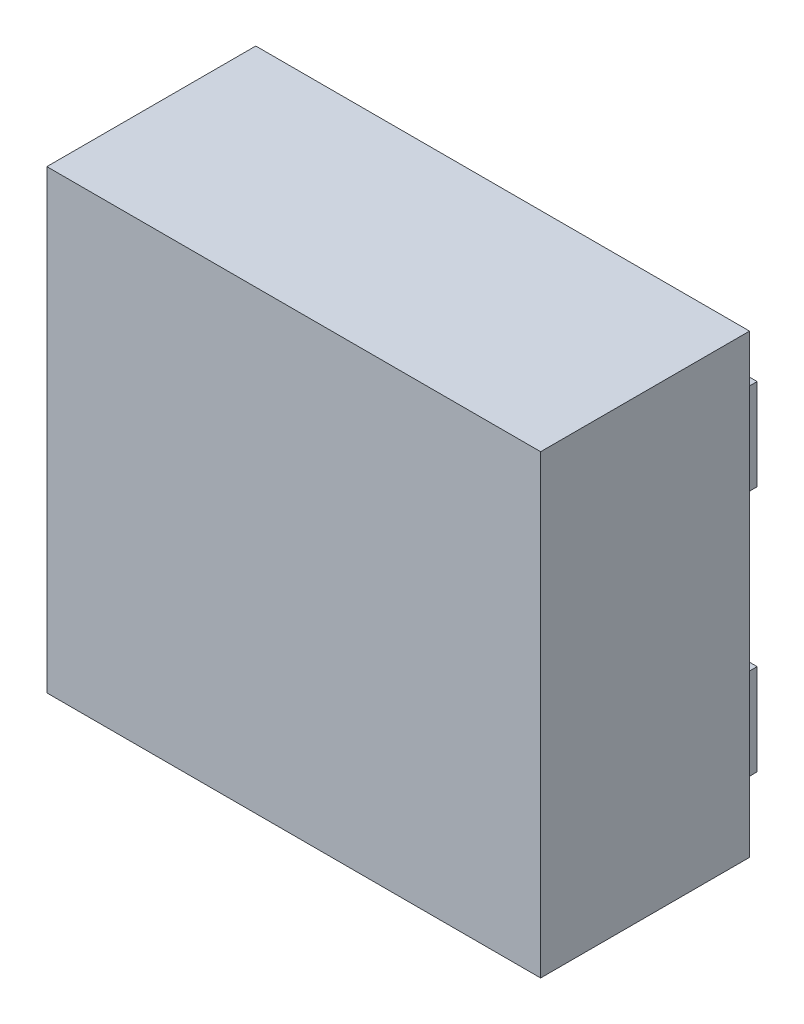
ISO-10303-21;
HEADER;
FILE_DESCRIPTION(('STEP AP214'),'2;1');
FILE_NAME('part.step','',(''),(''),'','','');
FILE_SCHEMA(('AUTOMOTIVE_DESIGN { 1 0 10303 214 1 1 1 1 }'));
ENDSEC;
DATA;
#1=APPLICATION_CONTEXT('core data for automotive mechanical design processes');
#2=APPLICATION_PROTOCOL_DEFINITION('international standard','automotive_design',2000,#1);
#3=PRODUCT_CONTEXT('',#1,'mechanical');
#4=PRODUCT('Part','Part','',(#3));
#5=PRODUCT_RELATED_PRODUCT_CATEGORY('part','',(#4));
#6=PRODUCT_DEFINITION_FORMATION('','',#4);
#7=PRODUCT_DEFINITION_CONTEXT('part definition',#1,'design');
#8=PRODUCT_DEFINITION('design','',#6,#7);
#9=PRODUCT_DEFINITION_SHAPE('','',#8);
#10=(LENGTH_UNIT() NAMED_UNIT(*) SI_UNIT(.MILLI.,.METRE.));
#11=(NAMED_UNIT(*) PLANE_ANGLE_UNIT() SI_UNIT($,.RADIAN.));
#12=(NAMED_UNIT(*) SI_UNIT($,.STERADIAN.) SOLID_ANGLE_UNIT());
#13=UNCERTAINTY_MEASURE_WITH_UNIT(LENGTH_MEASURE(1.E-05),#10,'distance_accuracy_value','');
#14=(GEOMETRIC_REPRESENTATION_CONTEXT(3) GLOBAL_UNCERTAINTY_ASSIGNED_CONTEXT((#13)) GLOBAL_UNIT_ASSIGNED_CONTEXT((#10,
#11,#12)) REPRESENTATION_CONTEXT('',''));
#15=CARTESIAN_POINT('',(0.,0.,0.));
#16=DIRECTION('',(0.,0.,1.));
#17=DIRECTION('',(1.,0.,0.));
#18=AXIS2_PLACEMENT_3D('',#15,#16,#17);
#19=CARTESIAN_POINT('',(0.,0.,1.2));
#20=DIRECTION('',(0.,0.,1.));
#21=DIRECTION('',(0.,-1.,0.));
#22=AXIS2_PLACEMENT_3D('',#19,#20,#21);
#23=PLANE('',#22);
#24=DIRECTION('',(-1.,0.,0.));
#25=VECTOR('',#24,1.);
#26=CARTESIAN_POINT('',(1.3,1.2,1.2));
#27=LINE('',#26,#25);
#28=CARTESIAN_POINT('',(1.3,1.2,1.2));
#29=VERTEX_POINT('',#28);
#30=CARTESIAN_POINT('',(-1.3,1.2,1.2));
#31=VERTEX_POINT('',#30);
#32=EDGE_CURVE('P0_E85',#29,#31,#27,.T.);
#33=ORIENTED_EDGE('',*,*,#32,.T.);
#34=DIRECTION('',(0.,-1.,0.));
#35=VECTOR('',#34,1.);
#36=CARTESIAN_POINT('',(-1.3,1.2,1.2));
#37=LINE('',#36,#35);
#38=CARTESIAN_POINT('',(-1.3,-1.2,1.2));
#39=VERTEX_POINT('',#38);
#40=EDGE_CURVE('P0_E70',#31,#39,#37,.T.);
#41=ORIENTED_EDGE('',*,*,#40,.T.);
#42=DIRECTION('',(1.,0.,0.));
#43=VECTOR('',#42,1.);
#44=CARTESIAN_POINT('',(-1.3,-1.2,1.2));
#45=LINE('',#44,#43);
#46=CARTESIAN_POINT('',(1.3,-1.2,1.2));
#47=VERTEX_POINT('',#46);
#48=EDGE_CURVE('P0_E75',#39,#47,#45,.T.);
#49=ORIENTED_EDGE('',*,*,#48,.T.);
#50=DIRECTION('',(0.,1.,0.));
#51=VECTOR('',#50,1.);
#52=CARTESIAN_POINT('',(1.3,-1.2,1.2));
#53=LINE('',#52,#51);
#54=EDGE_CURVE('P0_E10',#47,#29,#53,.T.);
#55=ORIENTED_EDGE('',*,*,#54,.T.);
#56=EDGE_LOOP('',(#33,#41,#49,#55));
#57=FACE_BOUND('',#56,.T.);
#58=ADVANCED_FACE('P0_F16',(#57),#23,.T.);
#59=CARTESIAN_POINT('',(0.,0.,0.1));
#60=DIRECTION('',(0.,0.,1.));
#61=DIRECTION('',(0.,-1.,0.));
#62=AXIS2_PLACEMENT_3D('',#59,#60,#61);
#63=PLANE('',#62);
#64=DIRECTION('',(-1.,0.,0.));
#65=VECTOR('',#64,1.);
#66=CARTESIAN_POINT('',(1.3,1.2,0.1));
#67=LINE('',#66,#65);
#68=CARTESIAN_POINT('',(1.3,1.2,0.1));
#69=VERTEX_POINT('',#68);
#70=CARTESIAN_POINT('',(-1.3,1.2,0.1));
#71=VERTEX_POINT('',#70);
#72=EDGE_CURVE('P0_E108',#69,#71,#67,.T.);
#73=ORIENTED_EDGE('',*,*,#72,.F.);
#74=DIRECTION('',(0.,1.,0.));
#75=VECTOR('',#74,1.);
#76=CARTESIAN_POINT('',(1.3,-1.2,0.1));
#77=LINE('',#76,#75);
#78=CARTESIAN_POINT('',(1.3,-1.2,0.1));
#79=VERTEX_POINT('',#78);
#80=EDGE_CURVE('P0_E24',#79,#69,#77,.T.);
#81=ORIENTED_EDGE('',*,*,#80,.F.);
#82=DIRECTION('',(1.,0.,0.));
#83=VECTOR('',#82,1.);
#84=CARTESIAN_POINT('',(-1.3,-1.2,0.1));
#85=LINE('',#84,#83);
#86=CARTESIAN_POINT('',(-1.3,-1.2,0.1));
#87=VERTEX_POINT('',#86);
#88=EDGE_CURVE('P0_E60',#87,#79,#85,.T.);
#89=ORIENTED_EDGE('',*,*,#88,.F.);
#90=DIRECTION('',(0.,-1.,0.));
#91=VECTOR('',#90,1.);
#92=CARTESIAN_POINT('',(-1.3,1.2,0.1));
#93=LINE('',#92,#91);
#94=EDGE_CURVE('P0_E64',#71,#87,#93,.T.);
#95=ORIENTED_EDGE('',*,*,#94,.F.);
#96=EDGE_LOOP('',(#73,#81,#89,#95));
#97=FACE_BOUND('',#96,.T.);
#98=ADVANCED_FACE('P0_F62',(#97),#63,.F.);
#99=CARTESIAN_POINT('',(1.3,-1.2,0.1));
#100=DIRECTION('',(-1.,0.,0.));
#101=DIRECTION('',(0.,0.,1.));
#102=AXIS2_PLACEMENT_3D('',#99,#100,#101);
#103=PLANE('',#102);
#104=DIRECTION('',(0.,0.,1.));
#105=VECTOR('',#104,1.);
#106=CARTESIAN_POINT('',(1.3,-1.2,0.1));
#107=LINE('',#106,#105);
#108=EDGE_CURVE('P0_E69',#79,#47,#107,.T.);
#109=ORIENTED_EDGE('',*,*,#108,.F.);
#110=ORIENTED_EDGE('',*,*,#80,.T.);
#111=DIRECTION('',(0.,0.,1.));
#112=VECTOR('',#111,1.);
#113=CARTESIAN_POINT('',(1.3,1.2,0.1));
#114=LINE('',#113,#112);
#115=EDGE_CURVE('P0_E107',#69,#29,#114,.T.);
#116=ORIENTED_EDGE('',*,*,#115,.T.);
#117=ORIENTED_EDGE('',*,*,#54,.F.);
#118=EDGE_LOOP('',(#109,#110,#116,#117));
#119=FACE_BOUND('',#118,.T.);
#120=ADVANCED_FACE('P0_F131',(#119),#103,.F.);
#121=CARTESIAN_POINT('',(-1.3,-1.2,0.1));
#122=DIRECTION('',(0.,1.,0.));
#123=DIRECTION('',(1.,0.,0.));
#124=AXIS2_PLACEMENT_3D('',#121,#122,#123);
#125=PLANE('',#124);
#126=DIRECTION('',(0.,0.,1.));
#127=VECTOR('',#126,1.);
#128=CARTESIAN_POINT('',(-1.3,-1.2,0.1));
#129=LINE('',#128,#127);
#130=EDGE_CURVE('P0_E73',#87,#39,#129,.T.);
#131=ORIENTED_EDGE('',*,*,#130,.F.);
#132=ORIENTED_EDGE('',*,*,#88,.T.);
#133=ORIENTED_EDGE('',*,*,#108,.T.);
#134=ORIENTED_EDGE('',*,*,#48,.F.);
#135=EDGE_LOOP('',(#131,#132,#133,#134));
#136=FACE_BOUND('',#135,.T.);
#137=ADVANCED_FACE('P0_F74',(#136),#125,.F.);
#138=CARTESIAN_POINT('',(-1.3,1.2,0.1));
#139=DIRECTION('',(1.,0.,0.));
#140=DIRECTION('',(0.,1.,0.));
#141=AXIS2_PLACEMENT_3D('',#138,#139,#140);
#142=PLANE('',#141);
#143=DIRECTION('',(0.,0.,1.));
#144=VECTOR('',#143,1.);
#145=CARTESIAN_POINT('',(-1.3,1.2,0.1));
#146=LINE('',#145,#144);
#147=EDGE_CURVE('P0_E82',#71,#31,#146,.T.);
#148=ORIENTED_EDGE('',*,*,#147,.F.);
#149=ORIENTED_EDGE('',*,*,#94,.T.);
#150=ORIENTED_EDGE('',*,*,#130,.T.);
#151=ORIENTED_EDGE('',*,*,#40,.F.);
#152=EDGE_LOOP('',(#148,#149,#150,#151));
#153=FACE_BOUND('',#152,.T.);
#154=ADVANCED_FACE('P0_F80',(#153),#142,.F.);
#155=CARTESIAN_POINT('',(1.3,1.2,0.1));
#156=DIRECTION('',(0.,-1.,0.));
#157=DIRECTION('',(0.,0.,-1.));
#158=AXIS2_PLACEMENT_3D('',#155,#156,#157);
#159=PLANE('',#158);
#160=ORIENTED_EDGE('',*,*,#115,.F.);
#161=ORIENTED_EDGE('',*,*,#72,.T.);
#162=ORIENTED_EDGE('',*,*,#147,.T.);
#163=ORIENTED_EDGE('',*,*,#32,.F.);
#164=EDGE_LOOP('',(#160,#161,#162,#163));
#165=FACE_BOUND('',#164,.T.);
#166=ADVANCED_FACE('P0_F117',(#165),#159,.F.);
#167=CLOSED_SHELL('',(#58,#98,#120,#137,#154,#166));
#168=MANIFOLD_SOLID_BREP('P0_B1',#167);
#169=CARTESIAN_POINT('',(0.485,-0.89,0.1));
#170=DIRECTION('',(0.,0.,1.));
#171=DIRECTION('',(1.,0.,0.));
#172=AXIS2_PLACEMENT_3D('',#169,#170,#171);
#173=PLANE('',#172);
#174=DIRECTION('',(0.,1.,0.));
#175=VECTOR('',#174,1.);
#176=CARTESIAN_POINT('',(0.485,-0.89,0.1));
#177=LINE('',#176,#175);
#178=CARTESIAN_POINT('',(0.485,-0.89,0.1));
#179=VERTEX_POINT('',#178);
#180=CARTESIAN_POINT('',(0.485,-0.41,0.1));
#181=VERTEX_POINT('',#180);
#182=EDGE_CURVE('P1_E94',#179,#181,#177,.T.);
#183=ORIENTED_EDGE('',*,*,#182,.F.);
#184=DIRECTION('',(1.,0.,0.));
#185=VECTOR('',#184,1.);
#186=CARTESIAN_POINT('',(0.485,-0.89,0.1));
#187=LINE('',#186,#185);
#188=CARTESIAN_POINT('',(1.24,-0.89,0.1));
#189=VERTEX_POINT('',#188);
#190=EDGE_CURVE('P1_E91',#179,#189,#187,.T.);
#191=ORIENTED_EDGE('',*,*,#190,.T.);
#192=DIRECTION('',(0.,1.,0.));
#193=VECTOR('',#192,1.);
#194=CARTESIAN_POINT('',(1.24,-0.89,0.1));
#195=LINE('',#194,#193);
#196=CARTESIAN_POINT('',(1.24,-0.41,0.1));
#197=VERTEX_POINT('',#196);
#198=EDGE_CURVE('P1_E110',#189,#197,#195,.T.);
#199=ORIENTED_EDGE('',*,*,#198,.T.);
#200=DIRECTION('',(1.,0.,0.));
#201=VECTOR('',#200,1.);
#202=CARTESIAN_POINT('',(0.485,-0.41,0.1));
#203=LINE('',#202,#201);
#204=EDGE_CURVE('P1_E11',#181,#197,#203,.T.);
#205=ORIENTED_EDGE('',*,*,#204,.F.);
#206=EDGE_LOOP('',(#183,#191,#199,#205));
#207=FACE_BOUND('',#206,.T.);
#208=ADVANCED_FACE('P1_F17',(#207),#173,.T.);
#209=CARTESIAN_POINT('',(0.485,-0.89,0.));
#210=DIRECTION('',(0.,0.,1.));
#211=DIRECTION('',(1.,0.,0.));
#212=AXIS2_PLACEMENT_3D('',#209,#210,#211);
#213=PLANE('',#212);
#214=DIRECTION('',(0.,1.,0.));
#215=VECTOR('',#214,1.);
#216=CARTESIAN_POINT('',(0.485,-0.89,0.));
#217=LINE('',#216,#215);
#218=CARTESIAN_POINT('',(0.485,-0.89,0.));
#219=VERTEX_POINT('',#218);
#220=CARTESIAN_POINT('',(0.485,-0.41,0.));
#221=VERTEX_POINT('',#220);
#222=EDGE_CURVE('P1_E70',#219,#221,#217,.T.);
#223=ORIENTED_EDGE('',*,*,#222,.T.);
#224=DIRECTION('',(1.,0.,0.));
#225=VECTOR('',#224,1.);
#226=CARTESIAN_POINT('',(0.485,-0.41,0.));
#227=LINE('',#226,#225);
#228=CARTESIAN_POINT('',(1.24,-0.41,0.));
#229=VERTEX_POINT('',#228);
#230=EDGE_CURVE('P1_E25',#221,#229,#227,.T.);
#231=ORIENTED_EDGE('',*,*,#230,.T.);
#232=DIRECTION('',(0.,1.,0.));
#233=VECTOR('',#232,1.);
#234=CARTESIAN_POINT('',(1.24,-0.89,0.));
#235=LINE('',#234,#233);
#236=CARTESIAN_POINT('',(1.24,-0.89,0.));
#237=VERTEX_POINT('',#236);
#238=EDGE_CURVE('P1_E73',#237,#229,#235,.T.);
#239=ORIENTED_EDGE('',*,*,#238,.F.);
#240=DIRECTION('',(1.,0.,0.));
#241=VECTOR('',#240,1.);
#242=CARTESIAN_POINT('',(0.485,-0.89,0.));
#243=LINE('',#242,#241);
#244=EDGE_CURVE('P1_E67',#219,#237,#243,.T.);
#245=ORIENTED_EDGE('',*,*,#244,.F.);
#246=EDGE_LOOP('',(#223,#231,#239,#245));
#247=FACE_BOUND('',#246,.T.);
#248=ADVANCED_FACE('P1_F69',(#247),#213,.F.);
#249=CARTESIAN_POINT('',(0.485,-0.41,0.));
#250=DIRECTION('',(0.,1.,0.));
#251=DIRECTION('',(1.,0.,0.));
#252=AXIS2_PLACEMENT_3D('',#249,#250,#251);
#253=PLANE('',#252);
#254=ORIENTED_EDGE('',*,*,#230,.F.);
#255=DIRECTION('',(0.,0.,1.));
#256=VECTOR('',#255,1.);
#257=CARTESIAN_POINT('',(0.485,-0.41,0.));
#258=LINE('',#257,#256);
#259=EDGE_CURVE('P1_E86',#221,#181,#258,.T.);
#260=ORIENTED_EDGE('',*,*,#259,.T.);
#261=ORIENTED_EDGE('',*,*,#204,.T.);
#262=DIRECTION('',(0.,0.,1.));
#263=VECTOR('',#262,1.);
#264=CARTESIAN_POINT('',(1.24,-0.41,0.));
#265=LINE('',#264,#263);
#266=EDGE_CURVE('P1_E105',#229,#197,#265,.T.);
#267=ORIENTED_EDGE('',*,*,#266,.F.);
#268=EDGE_LOOP('',(#254,#260,#261,#267));
#269=FACE_BOUND('',#268,.T.);
#270=ADVANCED_FACE('P1_F157',(#269),#253,.T.);
#271=CARTESIAN_POINT('',(1.24,-0.89,0.));
#272=DIRECTION('',(1.,0.,0.));
#273=DIRECTION('',(0.,1.,0.));
#274=AXIS2_PLACEMENT_3D('',#271,#272,#273);
#275=PLANE('',#274);
#276=DIRECTION('',(0.,0.,1.));
#277=VECTOR('',#276,1.);
#278=CARTESIAN_POINT('',(1.24,-0.89,0.));
#279=LINE('',#278,#277);
#280=EDGE_CURVE('P1_E79',#237,#189,#279,.T.);
#281=ORIENTED_EDGE('',*,*,#280,.F.);
#282=ORIENTED_EDGE('',*,*,#238,.T.);
#283=ORIENTED_EDGE('',*,*,#266,.T.);
#284=ORIENTED_EDGE('',*,*,#198,.F.);
#285=EDGE_LOOP('',(#281,#282,#283,#284));
#286=FACE_BOUND('',#285,.T.);
#287=ADVANCED_FACE('P1_F156',(#286),#275,.T.);
#288=CARTESIAN_POINT('',(0.485,-0.89,0.));
#289=DIRECTION('',(0.,1.,0.));
#290=DIRECTION('',(1.,0.,0.));
#291=AXIS2_PLACEMENT_3D('',#288,#289,#290);
#292=PLANE('',#291);
#293=ORIENTED_EDGE('',*,*,#244,.T.);
#294=ORIENTED_EDGE('',*,*,#280,.T.);
#295=ORIENTED_EDGE('',*,*,#190,.F.);
#296=DIRECTION('',(0.,0.,1.));
#297=VECTOR('',#296,1.);
#298=CARTESIAN_POINT('',(0.485,-0.89,0.));
#299=LINE('',#298,#297);
#300=EDGE_CURVE('P1_E85',#219,#179,#299,.T.);
#301=ORIENTED_EDGE('',*,*,#300,.F.);
#302=EDGE_LOOP('',(#293,#294,#295,#301));
#303=FACE_BOUND('',#302,.T.);
#304=ADVANCED_FACE('P1_F89',(#303),#292,.F.);
#305=CARTESIAN_POINT('',(0.485,-0.89,0.));
#306=DIRECTION('',(1.,0.,0.));
#307=DIRECTION('',(0.,1.,0.));
#308=AXIS2_PLACEMENT_3D('',#305,#306,#307);
#309=PLANE('',#308);
#310=ORIENTED_EDGE('',*,*,#300,.T.);
#311=ORIENTED_EDGE('',*,*,#182,.T.);
#312=ORIENTED_EDGE('',*,*,#259,.F.);
#313=ORIENTED_EDGE('',*,*,#222,.F.);
#314=EDGE_LOOP('',(#310,#311,#312,#313));
#315=FACE_BOUND('',#314,.T.);
#316=ADVANCED_FACE('P1_F83',(#315),#309,.F.);
#317=CLOSED_SHELL('',(#208,#248,#270,#287,#304,#316));
#318=MANIFOLD_SOLID_BREP('P1_B1',#317);
#319=CARTESIAN_POINT('',(0.485,0.41,0.1));
#320=DIRECTION('',(0.,0.,1.));
#321=DIRECTION('',(1.,0.,0.));
#322=AXIS2_PLACEMENT_3D('',#319,#320,#321);
#323=PLANE('',#322);
#324=DIRECTION('',(0.,1.,0.));
#325=VECTOR('',#324,1.);
#326=CARTESIAN_POINT('',(0.485,0.41,0.1));
#327=LINE('',#326,#325);
#328=CARTESIAN_POINT('',(0.485,0.41,0.1));
#329=VERTEX_POINT('',#328);
#330=CARTESIAN_POINT('',(0.485,0.89,0.1));
#331=VERTEX_POINT('',#330);
#332=EDGE_CURVE('P2_E88',#329,#331,#327,.T.);
#333=ORIENTED_EDGE('',*,*,#332,.F.);
#334=DIRECTION('',(1.,0.,0.));
#335=VECTOR('',#334,1.);
#336=CARTESIAN_POINT('',(0.485,0.41,0.1));
#337=LINE('',#336,#335);
#338=CARTESIAN_POINT('',(1.24,0.41,0.1));
#339=VERTEX_POINT('',#338);
#340=EDGE_CURVE('P2_E108',#329,#339,#337,.T.);
#341=ORIENTED_EDGE('',*,*,#340,.T.);
#342=DIRECTION('',(0.,1.,0.));
#343=VECTOR('',#342,1.);
#344=CARTESIAN_POINT('',(1.24,0.41,0.1));
#345=LINE('',#344,#343);
#346=CARTESIAN_POINT('',(1.24,0.89,0.1));
#347=VERTEX_POINT('',#346);
#348=EDGE_CURVE('P2_E75',#339,#347,#345,.T.);
#349=ORIENTED_EDGE('',*,*,#348,.T.);
#350=DIRECTION('',(1.,0.,0.));
#351=VECTOR('',#350,1.);
#352=CARTESIAN_POINT('',(0.485,0.89,0.1));
#353=LINE('',#352,#351);
#354=EDGE_CURVE('P2_E11',#331,#347,#353,.T.);
#355=ORIENTED_EDGE('',*,*,#354,.F.);
#356=EDGE_LOOP('',(#333,#341,#349,#355));
#357=FACE_BOUND('',#356,.T.);
#358=ADVANCED_FACE('P2_F17',(#357),#323,.T.);
#359=CARTESIAN_POINT('',(0.485,0.41,0.));
#360=DIRECTION('',(0.,0.,1.));
#361=DIRECTION('',(1.,0.,0.));
#362=AXIS2_PLACEMENT_3D('',#359,#360,#361);
#363=PLANE('',#362);
#364=DIRECTION('',(0.,1.,0.));
#365=VECTOR('',#364,1.);
#366=CARTESIAN_POINT('',(0.485,0.41,0.));
#367=LINE('',#366,#365);
#368=CARTESIAN_POINT('',(0.485,0.41,0.));
#369=VERTEX_POINT('',#368);
#370=CARTESIAN_POINT('',(0.485,0.89,0.));
#371=VERTEX_POINT('',#370);
#372=EDGE_CURVE('P2_E78',#369,#371,#367,.T.);
#373=ORIENTED_EDGE('',*,*,#372,.T.);
#374=DIRECTION('',(1.,0.,0.));
#375=VECTOR('',#374,1.);
#376=CARTESIAN_POINT('',(0.485,0.89,0.));
#377=LINE('',#376,#375);
#378=CARTESIAN_POINT('',(1.24,0.89,0.));
#379=VERTEX_POINT('',#378);
#380=EDGE_CURVE('P2_E26',#371,#379,#377,.T.);
#381=ORIENTED_EDGE('',*,*,#380,.T.);
#382=DIRECTION('',(0.,1.,0.));
#383=VECTOR('',#382,1.);
#384=CARTESIAN_POINT('',(1.24,0.41,0.));
#385=LINE('',#384,#383);
#386=CARTESIAN_POINT('',(1.24,0.41,0.));
#387=VERTEX_POINT('',#386);
#388=EDGE_CURVE('P2_E104',#387,#379,#385,.T.);
#389=ORIENTED_EDGE('',*,*,#388,.F.);
#390=DIRECTION('',(1.,0.,0.));
#391=VECTOR('',#390,1.);
#392=CARTESIAN_POINT('',(0.485,0.41,0.));
#393=LINE('',#392,#391);
#394=EDGE_CURVE('P2_E80',#369,#387,#393,.T.);
#395=ORIENTED_EDGE('',*,*,#394,.F.);
#396=EDGE_LOOP('',(#373,#381,#389,#395));
#397=FACE_BOUND('',#396,.T.);
#398=ADVANCED_FACE('P2_F19',(#397),#363,.F.);
#399=CARTESIAN_POINT('',(0.485,0.89,0.));
#400=DIRECTION('',(0.,1.,0.));
#401=DIRECTION('',(1.,0.,0.));
#402=AXIS2_PLACEMENT_3D('',#399,#400,#401);
#403=PLANE('',#402);
#404=ORIENTED_EDGE('',*,*,#380,.F.);
#405=DIRECTION('',(0.,0.,1.));
#406=VECTOR('',#405,1.);
#407=CARTESIAN_POINT('',(0.485,0.89,0.));
#408=LINE('',#407,#406);
#409=EDGE_CURVE('P2_E69',#371,#331,#408,.T.);
#410=ORIENTED_EDGE('',*,*,#409,.T.);
#411=ORIENTED_EDGE('',*,*,#354,.T.);
#412=DIRECTION('',(0.,0.,1.));
#413=VECTOR('',#412,1.);
#414=CARTESIAN_POINT('',(1.24,0.89,0.));
#415=LINE('',#414,#413);
#416=EDGE_CURVE('P2_E72',#379,#347,#415,.T.);
#417=ORIENTED_EDGE('',*,*,#416,.F.);
#418=EDGE_LOOP('',(#404,#410,#411,#417));
#419=FACE_BOUND('',#418,.T.);
#420=ADVANCED_FACE('P2_F67',(#419),#403,.T.);
#421=CARTESIAN_POINT('',(1.24,0.41,0.));
#422=DIRECTION('',(1.,0.,0.));
#423=DIRECTION('',(0.,1.,0.));
#424=AXIS2_PLACEMENT_3D('',#421,#422,#423);
#425=PLANE('',#424);
#426=DIRECTION('',(0.,0.,1.));
#427=VECTOR('',#426,1.);
#428=CARTESIAN_POINT('',(1.24,0.41,0.));
#429=LINE('',#428,#427);
#430=EDGE_CURVE('P2_E101',#387,#339,#429,.T.);
#431=ORIENTED_EDGE('',*,*,#430,.F.);
#432=ORIENTED_EDGE('',*,*,#388,.T.);
#433=ORIENTED_EDGE('',*,*,#416,.T.);
#434=ORIENTED_EDGE('',*,*,#348,.F.);
#435=EDGE_LOOP('',(#431,#432,#433,#434));
#436=FACE_BOUND('',#435,.T.);
#437=ADVANCED_FACE('P2_F119',(#436),#425,.T.);
#438=CARTESIAN_POINT('',(0.485,0.41,0.));
#439=DIRECTION('',(0.,1.,0.));
#440=DIRECTION('',(1.,0.,0.));
#441=AXIS2_PLACEMENT_3D('',#438,#439,#440);
#442=PLANE('',#441);
#443=ORIENTED_EDGE('',*,*,#394,.T.);
#444=ORIENTED_EDGE('',*,*,#430,.T.);
#445=ORIENTED_EDGE('',*,*,#340,.F.);
#446=DIRECTION('',(0.,0.,1.));
#447=VECTOR('',#446,1.);
#448=CARTESIAN_POINT('',(0.485,0.41,0.));
#449=LINE('',#448,#447);
#450=EDGE_CURVE('P2_E95',#369,#329,#449,.T.);
#451=ORIENTED_EDGE('',*,*,#450,.F.);
#452=EDGE_LOOP('',(#443,#444,#445,#451));
#453=FACE_BOUND('',#452,.T.);
#454=ADVANCED_FACE('P2_F121',(#453),#442,.F.);
#455=CARTESIAN_POINT('',(0.485,0.41,0.));
#456=DIRECTION('',(1.,0.,0.));
#457=DIRECTION('',(0.,1.,0.));
#458=AXIS2_PLACEMENT_3D('',#455,#456,#457);
#459=PLANE('',#458);
#460=ORIENTED_EDGE('',*,*,#450,.T.);
#461=ORIENTED_EDGE('',*,*,#332,.T.);
#462=ORIENTED_EDGE('',*,*,#409,.F.);
#463=ORIENTED_EDGE('',*,*,#372,.F.);
#464=EDGE_LOOP('',(#460,#461,#462,#463));
#465=FACE_BOUND('',#464,.T.);
#466=ADVANCED_FACE('P2_F86',(#465),#459,.F.);
#467=CLOSED_SHELL('',(#358,#398,#420,#437,#454,#466));
#468=MANIFOLD_SOLID_BREP('P2_B1',#467);
#469=CARTESIAN_POINT('',(-1.24,0.41,0.1));
#470=DIRECTION('',(0.,0.,1.));
#471=DIRECTION('',(1.,0.,0.));
#472=AXIS2_PLACEMENT_3D('',#469,#470,#471);
#473=PLANE('',#472);
#474=DIRECTION('',(0.,1.,0.));
#475=VECTOR('',#474,1.);
#476=CARTESIAN_POINT('',(-1.24,0.41,0.1));
#477=LINE('',#476,#475);
#478=CARTESIAN_POINT('',(-1.24,0.41,0.1));
#479=VERTEX_POINT('',#478);
#480=CARTESIAN_POINT('',(-1.24,0.89,0.1));
#481=VERTEX_POINT('',#480);
#482=EDGE_CURVE('P3_E92',#479,#481,#477,.T.);
#483=ORIENTED_EDGE('',*,*,#482,.F.);
#484=DIRECTION('',(1.,0.,0.));
#485=VECTOR('',#484,1.);
#486=CARTESIAN_POINT('',(-1.24,0.41,0.1));
#487=LINE('',#486,#485);
#488=CARTESIAN_POINT('',(-0.485,0.41,0.1));
#489=VERTEX_POINT('',#488);
#490=EDGE_CURVE('P3_E89',#479,#489,#487,.T.);
#491=ORIENTED_EDGE('',*,*,#490,.T.);
#492=DIRECTION('',(0.,1.,0.));
#493=VECTOR('',#492,1.);
#494=CARTESIAN_POINT('',(-0.485,0.41,0.1));
#495=LINE('',#494,#493);
#496=CARTESIAN_POINT('',(-0.485,0.89,0.1));
#497=VERTEX_POINT('',#496);
#498=EDGE_CURVE('P3_E100',#489,#497,#495,.T.);
#499=ORIENTED_EDGE('',*,*,#498,.T.);
#500=DIRECTION('',(1.,0.,0.));
#501=VECTOR('',#500,1.);
#502=CARTESIAN_POINT('',(-1.24,0.89,0.1));
#503=LINE('',#502,#501);
#504=EDGE_CURVE('P3_E11',#481,#497,#503,.T.);
#505=ORIENTED_EDGE('',*,*,#504,.F.);
#506=EDGE_LOOP('',(#483,#491,#499,#505));
#507=FACE_BOUND('',#506,.T.);
#508=ADVANCED_FACE('P3_F17',(#507),#473,.T.);
#509=CARTESIAN_POINT('',(-1.24,0.41,0.));
#510=DIRECTION('',(0.,0.,1.));
#511=DIRECTION('',(1.,0.,0.));
#512=AXIS2_PLACEMENT_3D('',#509,#510,#511);
#513=PLANE('',#512);
#514=DIRECTION('',(0.,1.,0.));
#515=VECTOR('',#514,1.);
#516=CARTESIAN_POINT('',(-1.24,0.41,0.));
#517=LINE('',#516,#515);
#518=CARTESIAN_POINT('',(-1.24,0.41,0.));
#519=VERTEX_POINT('',#518);
#520=CARTESIAN_POINT('',(-1.24,0.89,0.));
#521=VERTEX_POINT('',#520);
#522=EDGE_CURVE('P3_E68',#519,#521,#517,.T.);
#523=ORIENTED_EDGE('',*,*,#522,.T.);
#524=DIRECTION('',(1.,0.,0.));
#525=VECTOR('',#524,1.);
#526=CARTESIAN_POINT('',(-1.24,0.89,0.));
#527=LINE('',#526,#525);
#528=CARTESIAN_POINT('',(-0.485,0.89,0.));
#529=VERTEX_POINT('',#528);
#530=EDGE_CURVE('P3_E26',#521,#529,#527,.T.);
#531=ORIENTED_EDGE('',*,*,#530,.T.);
#532=DIRECTION('',(0.,1.,0.));
#533=VECTOR('',#532,1.);
#534=CARTESIAN_POINT('',(-0.485,0.41,0.));
#535=LINE('',#534,#533);
#536=CARTESIAN_POINT('',(-0.485,0.41,0.));
#537=VERTEX_POINT('',#536);
#538=EDGE_CURVE('P3_E71',#537,#529,#535,.T.);
#539=ORIENTED_EDGE('',*,*,#538,.F.);
#540=DIRECTION('',(1.,0.,0.));
#541=VECTOR('',#540,1.);
#542=CARTESIAN_POINT('',(-1.24,0.41,0.));
#543=LINE('',#542,#541);
#544=EDGE_CURVE('P3_E65',#519,#537,#543,.T.);
#545=ORIENTED_EDGE('',*,*,#544,.F.);
#546=EDGE_LOOP('',(#523,#531,#539,#545));
#547=FACE_BOUND('',#546,.T.);
#548=ADVANCED_FACE('P3_F67',(#547),#513,.F.);
#549=CARTESIAN_POINT('',(-1.24,0.89,0.));
#550=DIRECTION('',(0.,1.,0.));
#551=DIRECTION('',(1.,0.,0.));
#552=AXIS2_PLACEMENT_3D('',#549,#550,#551);
#553=PLANE('',#552);
#554=ORIENTED_EDGE('',*,*,#530,.F.);
#555=DIRECTION('',(0.,0.,1.));
#556=VECTOR('',#555,1.);
#557=CARTESIAN_POINT('',(-1.24,0.89,0.));
#558=LINE('',#557,#556);
#559=EDGE_CURVE('P3_E84',#521,#481,#558,.T.);
#560=ORIENTED_EDGE('',*,*,#559,.T.);
#561=ORIENTED_EDGE('',*,*,#504,.T.);
#562=DIRECTION('',(0.,0.,1.));
#563=VECTOR('',#562,1.);
#564=CARTESIAN_POINT('',(-0.485,0.89,0.));
#565=LINE('',#564,#563);
#566=EDGE_CURVE('P3_E107',#529,#497,#565,.T.);
#567=ORIENTED_EDGE('',*,*,#566,.F.);
#568=EDGE_LOOP('',(#554,#560,#561,#567));
#569=FACE_BOUND('',#568,.T.);
#570=ADVANCED_FACE('P3_F122',(#569),#553,.T.);
#571=CARTESIAN_POINT('',(-0.485,0.41,0.));
#572=DIRECTION('',(1.,0.,0.));
#573=DIRECTION('',(0.,1.,0.));
#574=AXIS2_PLACEMENT_3D('',#571,#572,#573);
#575=PLANE('',#574);
#576=DIRECTION('',(0.,0.,1.));
#577=VECTOR('',#576,1.);
#578=CARTESIAN_POINT('',(-0.485,0.41,0.));
#579=LINE('',#578,#577);
#580=EDGE_CURVE('P3_E77',#537,#489,#579,.T.);
#581=ORIENTED_EDGE('',*,*,#580,.F.);
#582=ORIENTED_EDGE('',*,*,#538,.T.);
#583=ORIENTED_EDGE('',*,*,#566,.T.);
#584=ORIENTED_EDGE('',*,*,#498,.F.);
#585=EDGE_LOOP('',(#581,#582,#583,#584));
#586=FACE_BOUND('',#585,.T.);
#587=ADVANCED_FACE('P3_F121',(#586),#575,.T.);
#588=CARTESIAN_POINT('',(-1.24,0.41,0.));
#589=DIRECTION('',(0.,1.,0.));
#590=DIRECTION('',(1.,0.,0.));
#591=AXIS2_PLACEMENT_3D('',#588,#589,#590);
#592=PLANE('',#591);
#593=ORIENTED_EDGE('',*,*,#544,.T.);
#594=ORIENTED_EDGE('',*,*,#580,.T.);
#595=ORIENTED_EDGE('',*,*,#490,.F.);
#596=DIRECTION('',(0.,0.,1.));
#597=VECTOR('',#596,1.);
#598=CARTESIAN_POINT('',(-1.24,0.41,0.));
#599=LINE('',#598,#597);
#600=EDGE_CURVE('P3_E83',#519,#479,#599,.T.);
#601=ORIENTED_EDGE('',*,*,#600,.F.);
#602=EDGE_LOOP('',(#593,#594,#595,#601));
#603=FACE_BOUND('',#602,.T.);
#604=ADVANCED_FACE('P3_F87',(#603),#592,.F.);
#605=CARTESIAN_POINT('',(-1.24,0.41,0.));
#606=DIRECTION('',(1.,0.,0.));
#607=DIRECTION('',(0.,1.,0.));
#608=AXIS2_PLACEMENT_3D('',#605,#606,#607);
#609=PLANE('',#608);
#610=ORIENTED_EDGE('',*,*,#600,.T.);
#611=ORIENTED_EDGE('',*,*,#482,.T.);
#612=ORIENTED_EDGE('',*,*,#559,.F.);
#613=ORIENTED_EDGE('',*,*,#522,.F.);
#614=EDGE_LOOP('',(#610,#611,#612,#613));
#615=FACE_BOUND('',#614,.T.);
#616=ADVANCED_FACE('P3_F81',(#615),#609,.F.);
#617=CLOSED_SHELL('',(#508,#548,#570,#587,#604,#616));
#618=MANIFOLD_SOLID_BREP('P3_B1',#617);
#619=CARTESIAN_POINT('',(-1.24,-0.89,0.1));
#620=DIRECTION('',(0.,0.,1.));
#621=DIRECTION('',(1.,0.,0.));
#622=AXIS2_PLACEMENT_3D('',#619,#620,#621);
#623=PLANE('',#622);
#624=DIRECTION('',(0.,1.,0.));
#625=VECTOR('',#624,1.);
#626=CARTESIAN_POINT('',(-1.24,-0.89,0.1));
#627=LINE('',#626,#625);
#628=CARTESIAN_POINT('',(-1.24,-0.89,0.1));
#629=VERTEX_POINT('',#628);
#630=CARTESIAN_POINT('',(-1.24,-0.41,0.1));
#631=VERTEX_POINT('',#630);
#632=EDGE_CURVE('P4_E95',#629,#631,#627,.T.);
#633=ORIENTED_EDGE('',*,*,#632,.F.);
#634=DIRECTION('',(1.,0.,0.));
#635=VECTOR('',#634,1.);
#636=CARTESIAN_POINT('',(-1.24,-0.89,0.1));
#637=LINE('',#636,#635);
#638=CARTESIAN_POINT('',(-0.485,-0.89,0.1));
#639=VERTEX_POINT('',#638);
#640=EDGE_CURVE('P4_E92',#629,#639,#637,.T.);
#641=ORIENTED_EDGE('',*,*,#640,.T.);
#642=DIRECTION('',(0.,1.,0.));
#643=VECTOR('',#642,1.);
#644=CARTESIAN_POINT('',(-0.485,-0.89,0.1));
#645=LINE('',#644,#643);
#646=CARTESIAN_POINT('',(-0.485,-0.41,0.1));
#647=VERTEX_POINT('',#646);
#648=EDGE_CURVE('P4_E114',#639,#647,#645,.T.);
#649=ORIENTED_EDGE('',*,*,#648,.T.);
#650=DIRECTION('',(1.,0.,0.));
#651=VECTOR('',#650,1.);
#652=CARTESIAN_POINT('',(-1.24,-0.41,0.1));
#653=LINE('',#652,#651);
#654=EDGE_CURVE('P4_E11',#631,#647,#653,.T.);
#655=ORIENTED_EDGE('',*,*,#654,.F.);
#656=EDGE_LOOP('',(#633,#641,#649,#655));
#657=FACE_BOUND('',#656,.T.);
#658=ADVANCED_FACE('P4_F17',(#657),#623,.T.);
#659=CARTESIAN_POINT('',(-1.24,-0.89,0.));
#660=DIRECTION('',(0.,0.,1.));
#661=DIRECTION('',(1.,0.,0.));
#662=AXIS2_PLACEMENT_3D('',#659,#660,#661);
#663=PLANE('',#662);
#664=DIRECTION('',(0.,1.,0.));
#665=VECTOR('',#664,1.);
#666=CARTESIAN_POINT('',(-1.24,-0.89,0.));
#667=LINE('',#666,#665);
#668=CARTESIAN_POINT('',(-1.24,-0.89,0.));
#669=VERTEX_POINT('',#668);
#670=CARTESIAN_POINT('',(-1.24,-0.41,0.));
#671=VERTEX_POINT('',#670);
#672=EDGE_CURVE('P4_E71',#669,#671,#667,.T.);
#673=ORIENTED_EDGE('',*,*,#672,.T.);
#674=DIRECTION('',(1.,0.,0.));
#675=VECTOR('',#674,1.);
#676=CARTESIAN_POINT('',(-1.24,-0.41,0.));
#677=LINE('',#676,#675);
#678=CARTESIAN_POINT('',(-0.485,-0.41,0.));
#679=VERTEX_POINT('',#678);
#680=EDGE_CURVE('P4_E21',#671,#679,#677,.T.);
#681=ORIENTED_EDGE('',*,*,#680,.T.);
#682=DIRECTION('',(0.,1.,0.));
#683=VECTOR('',#682,1.);
#684=CARTESIAN_POINT('',(-0.485,-0.89,0.));
#685=LINE('',#684,#683);
#686=CARTESIAN_POINT('',(-0.485,-0.89,0.));
#687=VERTEX_POINT('',#686);
#688=EDGE_CURVE('P4_E74',#687,#679,#685,.T.);
#689=ORIENTED_EDGE('',*,*,#688,.F.);
#690=DIRECTION('',(1.,0.,0.));
#691=VECTOR('',#690,1.);
#692=CARTESIAN_POINT('',(-1.24,-0.89,0.));
#693=LINE('',#692,#691);
#694=EDGE_CURVE('P4_E69',#669,#687,#693,.T.);
#695=ORIENTED_EDGE('',*,*,#694,.F.);
#696=EDGE_LOOP('',(#673,#681,#689,#695));
#697=FACE_BOUND('',#696,.T.);
#698=ADVANCED_FACE('P4_F19',(#697),#663,.F.);
#699=CARTESIAN_POINT('',(-1.24,-0.41,0.));
#700=DIRECTION('',(0.,1.,0.));
#701=DIRECTION('',(1.,0.,0.));
#702=AXIS2_PLACEMENT_3D('',#699,#700,#701);
#703=PLANE('',#702);
#704=ORIENTED_EDGE('',*,*,#680,.F.);
#705=DIRECTION('',(0.,0.,1.));
#706=VECTOR('',#705,1.);
#707=CARTESIAN_POINT('',(-1.24,-0.41,0.));
#708=LINE('',#707,#706);
#709=EDGE_CURVE('P4_E87',#671,#631,#708,.T.);
#710=ORIENTED_EDGE('',*,*,#709,.T.);
#711=ORIENTED_EDGE('',*,*,#654,.T.);
#712=DIRECTION('',(0.,0.,1.));
#713=VECTOR('',#712,1.);
#714=CARTESIAN_POINT('',(-0.485,-0.41,0.));
#715=LINE('',#714,#713);
#716=EDGE_CURVE('P4_E111',#679,#647,#715,.T.);
#717=ORIENTED_EDGE('',*,*,#716,.F.);
#718=EDGE_LOOP('',(#704,#710,#711,#717));
#719=FACE_BOUND('',#718,.T.);
#720=ADVANCED_FACE('P4_F158',(#719),#703,.T.);
#721=CARTESIAN_POINT('',(-0.485,-0.89,0.));
#722=DIRECTION('',(1.,0.,0.));
#723=DIRECTION('',(0.,1.,0.));
#724=AXIS2_PLACEMENT_3D('',#721,#722,#723);
#725=PLANE('',#724);
#726=DIRECTION('',(0.,0.,1.));
#727=VECTOR('',#726,1.);
#728=CARTESIAN_POINT('',(-0.485,-0.89,0.));
#729=LINE('',#728,#727);
#730=EDGE_CURVE('P4_E80',#687,#639,#729,.T.);
#731=ORIENTED_EDGE('',*,*,#730,.F.);
#732=ORIENTED_EDGE('',*,*,#688,.T.);
#733=ORIENTED_EDGE('',*,*,#716,.T.);
#734=ORIENTED_EDGE('',*,*,#648,.F.);
#735=EDGE_LOOP('',(#731,#732,#733,#734));
#736=FACE_BOUND('',#735,.T.);
#737=ADVANCED_FACE('P4_F146',(#736),#725,.T.);
#738=CARTESIAN_POINT('',(-1.24,-0.89,0.));
#739=DIRECTION('',(0.,1.,0.));
#740=DIRECTION('',(1.,0.,0.));
#741=AXIS2_PLACEMENT_3D('',#738,#739,#740);
#742=PLANE('',#741);
#743=ORIENTED_EDGE('',*,*,#694,.T.);
#744=ORIENTED_EDGE('',*,*,#730,.T.);
#745=ORIENTED_EDGE('',*,*,#640,.F.);
#746=DIRECTION('',(0.,0.,1.));
#747=VECTOR('',#746,1.);
#748=CARTESIAN_POINT('',(-1.24,-0.89,0.));
#749=LINE('',#748,#747);
#750=EDGE_CURVE('P4_E86',#669,#629,#749,.T.);
#751=ORIENTED_EDGE('',*,*,#750,.F.);
#752=EDGE_LOOP('',(#743,#744,#745,#751));
#753=FACE_BOUND('',#752,.T.);
#754=ADVANCED_FACE('P4_F90',(#753),#742,.F.);
#755=CARTESIAN_POINT('',(-1.24,-0.89,0.));
#756=DIRECTION('',(1.,0.,0.));
#757=DIRECTION('',(0.,1.,0.));
#758=AXIS2_PLACEMENT_3D('',#755,#756,#757);
#759=PLANE('',#758);
#760=ORIENTED_EDGE('',*,*,#750,.T.);
#761=ORIENTED_EDGE('',*,*,#632,.T.);
#762=ORIENTED_EDGE('',*,*,#709,.F.);
#763=ORIENTED_EDGE('',*,*,#672,.F.);
#764=EDGE_LOOP('',(#760,#761,#762,#763));
#765=FACE_BOUND('',#764,.T.);
#766=ADVANCED_FACE('P4_F84',(#765),#759,.F.);
#767=CLOSED_SHELL('',(#658,#698,#720,#737,#754,#766));
#768=MANIFOLD_SOLID_BREP('P4_B1',#767);
#769=ADVANCED_BREP_SHAPE_REPRESENTATION('',(#18,#168,#318,#468,#618,#768),#14);
#770=SHAPE_DEFINITION_REPRESENTATION(#9,#769);
ENDSEC;
END-ISO-10303-21;
